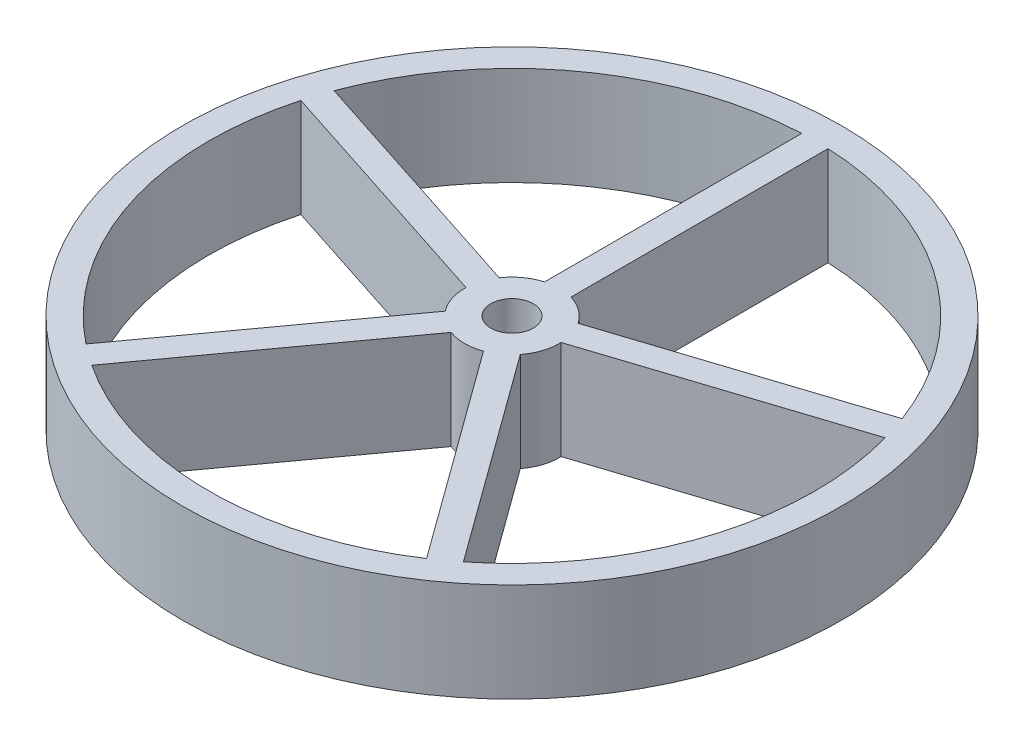
ISO-10303-21;
HEADER;
FILE_DESCRIPTION(('STEP AP214'),'2;1');
FILE_NAME('part.step','',(''),(''),'','','');
FILE_SCHEMA(('AUTOMOTIVE_DESIGN { 1 0 10303 214 1 1 1 1 }'));
ENDSEC;
DATA;
#1=APPLICATION_CONTEXT('core data for automotive mechanical design processes');
#2=APPLICATION_PROTOCOL_DEFINITION('international standard','automotive_design',2000,#1);
#3=PRODUCT_CONTEXT('',#1,'mechanical');
#4=PRODUCT('Part','Part','',(#3));
#5=PRODUCT_RELATED_PRODUCT_CATEGORY('part','',(#4));
#6=PRODUCT_DEFINITION_FORMATION('','',#4);
#7=PRODUCT_DEFINITION_CONTEXT('part definition',#1,'design');
#8=PRODUCT_DEFINITION('design','',#6,#7);
#9=PRODUCT_DEFINITION_SHAPE('','',#8);
#10=(LENGTH_UNIT() NAMED_UNIT(*) SI_UNIT(.MILLI.,.METRE.));
#11=(NAMED_UNIT(*) PLANE_ANGLE_UNIT() SI_UNIT($,.RADIAN.));
#12=(NAMED_UNIT(*) SI_UNIT($,.STERADIAN.) SOLID_ANGLE_UNIT());
#13=UNCERTAINTY_MEASURE_WITH_UNIT(LENGTH_MEASURE(1.E-05),#10,'distance_accuracy_value','');
#14=(GEOMETRIC_REPRESENTATION_CONTEXT(3) GLOBAL_UNCERTAINTY_ASSIGNED_CONTEXT((#13)) GLOBAL_UNIT_ASSIGNED_CONTEXT((#10,
#11,#12)) REPRESENTATION_CONTEXT('',''));
#15=CARTESIAN_POINT('',(0.,0.,0.));
#16=DIRECTION('',(0.,0.,1.));
#17=DIRECTION('',(1.,0.,0.));
#18=AXIS2_PLACEMENT_3D('',#15,#16,#17);
#19=CARTESIAN_POINT('',(0.,7.5,0.));
#20=DIRECTION('',(0.,1.,0.));
#21=DIRECTION('',(0.,0.,1.));
#22=AXIS2_PLACEMENT_3D('',#19,#20,#21);
#23=PLANE('',#22);
#24=DIRECTION('',(0.587785252292706,0.,-0.809016994374778));
#25=VECTOR('',#24,1.);
#26=CARTESIAN_POINT('',(0.809016994375061,7.5,0.587785252292911));
#27=LINE('',#26,#25);
#28=CARTESIAN_POINT('',(-12.6972598236514,7.5,19.1775804774922));
#29=VERTEX_POINT('',#28);
#30=CARTESIAN_POINT('',(-1.22985237637781,7.5,3.39404819239791));
#31=VERTEX_POINT('',#30);
#32=EDGE_CURVE('E294',#29,#31,#27,.T.);
#33=ORIENTED_EDGE('',*,*,#32,.T.);
#34=CARTESIAN_POINT('',(1.60461921527855E-13,7.5,1.00397121172158E-13));
#35=DIRECTION('',(0.,1.,0.));
#36=DIRECTION('',(0.,0.,1.));
#37=AXIS2_PLACEMENT_3D('',#34,#35,#36);
#38=CIRCLE('',#37,3.61000000000019);
#39=CARTESIAN_POINT('',(1.22985237637682,7.5,3.39404819239838));
#40=VERTEX_POINT('',#39);
#41=EDGE_CURVE('E289',#31,#40,#38,.T.);
#42=ORIENTED_EDGE('',*,*,#41,.T.);
#43=DIRECTION('',(-0.587785252292318,0.,-0.80901699437506));
#44=VECTOR('',#43,1.);
#45=CARTESIAN_POINT('',(-0.809016994374873,7.5,0.587785252292182));
#46=LINE('',#45,#44);
#47=CARTESIAN_POINT('',(12.6972598236427,7.5,19.1775804774979));
#48=VERTEX_POINT('',#47);
#49=EDGE_CURVE('E300',#48,#40,#46,.T.);
#50=ORIENTED_EDGE('',*,*,#49,.F.);
#51=CARTESIAN_POINT('',(0.,7.5,0.));
#52=DIRECTION('',(0.,1.,0.));
#53=DIRECTION('',(0.,0.,1.));
#54=AXIS2_PLACEMENT_3D('',#51,#52,#53);
#55=CIRCLE('',#54,23.);
#56=EDGE_CURVE('E297',#29,#48,#55,.T.);
#57=ORIENTED_EDGE('',*,*,#56,.F.);
#58=EDGE_LOOP('',(#33,#42,#50,#57));
#59=FACE_BOUND('',#58,.T.);
#60=DIRECTION('',(-0.951056516295185,0.,0.309016994374852));
#61=VECTOR('',#60,1.);
#62=CARTESIAN_POINT('',(-0.30901699437489,7.5,-0.9510565162953));
#63=LINE('',#62,#61);
#64=CARTESIAN_POINT('',(21.5445979586487,7.5,-8.05172644842021));
#65=VERTEX_POINT('',#64);
#66=CARTESIAN_POINT('',(2.98994294612327,7.5,-2.02295357804612));
#67=VERTEX_POINT('',#66);
#68=EDGE_CURVE('E336',#65,#67,#63,.T.);
#69=ORIENTED_EDGE('',*,*,#68,.T.);
#70=CARTESIAN_POINT('',(1.60461921527855E-13,7.5,1.00397121172158E-13));
#71=DIRECTION('',(0.,1.,0.));
#72=DIRECTION('',(0.,0.,1.));
#73=AXIS2_PLACEMENT_3D('',#70,#71,#72);
#74=CIRCLE('',#73,3.61000000000019);
#75=CARTESIAN_POINT('',(1.,7.5,-3.46873175670893));
#76=VERTEX_POINT('',#75);
#77=EDGE_CURVE('E327',#67,#76,#74,.T.);
#78=ORIENTED_EDGE('',*,*,#77,.T.);
#79=DIRECTION('',(0.,0.,1.));
#80=VECTOR('',#79,1.);
#81=CARTESIAN_POINT('',(1.,7.5,0.));
#82=LINE('',#81,#80);
#83=CARTESIAN_POINT('',(1.,7.5,-22.9782505861521));
#84=VERTEX_POINT('',#83);
#85=EDGE_CURVE('E342',#84,#76,#82,.T.);
#86=ORIENTED_EDGE('',*,*,#85,.F.);
#87=CARTESIAN_POINT('',(0.,7.5,0.));
#88=DIRECTION('',(0.,1.,0.));
#89=DIRECTION('',(0.,0.,1.));
#90=AXIS2_PLACEMENT_3D('',#87,#88,#89);
#91=CIRCLE('',#90,23.);
#92=EDGE_CURVE('E339',#65,#84,#91,.T.);
#93=ORIENTED_EDGE('',*,*,#92,.F.);
#94=EDGE_LOOP('',(#69,#78,#86,#93));
#95=FACE_BOUND('',#94,.T.);
#96=CARTESIAN_POINT('',(0.,7.5,0.));
#97=DIRECTION('',(0.,1.,0.));
#98=DIRECTION('',(0.,0.,1.));
#99=AXIS2_PLACEMENT_3D('',#96,#97,#98);
#100=CIRCLE('',#99,1.61);
#101=CARTESIAN_POINT('',(0.,7.5,1.61));
#102=VERTEX_POINT('',#101);
#103=EDGE_CURVE('E376',#102,#102,#100,.T.);
#104=ORIENTED_EDGE('',*,*,#103,.F.);
#105=EDGE_LOOP('',(#104));
#106=FACE_BOUND('',#105,.T.);
#107=CARTESIAN_POINT('',(0.,7.5,0.));
#108=DIRECTION('',(0.,1.,0.));
#109=DIRECTION('',(0.,0.,1.));
#110=AXIS2_PLACEMENT_3D('',#107,#108,#109);
#111=CIRCLE('',#110,25.);
#112=CARTESIAN_POINT('',(0.,7.5,25.));
#113=VERTEX_POINT('',#112);
#114=EDGE_CURVE('E382',#113,#113,#111,.T.);
#115=ORIENTED_EDGE('',*,*,#114,.T.);
#116=EDGE_LOOP('',(#115));
#117=FACE_BOUND('',#116,.T.);
#118=DIRECTION('',(0.,0.,1.));
#119=VECTOR('',#118,1.);
#120=CARTESIAN_POINT('',(-0.999999999999998,7.5,0.));
#121=LINE('',#120,#119);
#122=CARTESIAN_POINT('',(-1.,7.5,-22.9782505861521));
#123=VERTEX_POINT('',#122);
#124=CARTESIAN_POINT('',(-0.999999999999998,7.5,-3.46873175670883));
#125=VERTEX_POINT('',#124);
#126=EDGE_CURVE('E357',#123,#125,#121,.T.);
#127=ORIENTED_EDGE('',*,*,#126,.T.);
#128=CARTESIAN_POINT('',(1.60461921527855E-13,7.5,1.00397121172158E-13));
#129=DIRECTION('',(0.,1.,0.));
#130=DIRECTION('',(0.,0.,1.));
#131=AXIS2_PLACEMENT_3D('',#128,#129,#130);
#132=CIRCLE('',#131,3.61000000000019);
#133=CARTESIAN_POINT('',(-2.98994294612222,7.5,-2.0229535780472));
#134=VERTEX_POINT('',#133);
#135=EDGE_CURVE('E348',#125,#134,#132,.T.);
#136=ORIENTED_EDGE('',*,*,#135,.T.);
#137=DIRECTION('',(0.951056516295035,0.,0.309016994375312));
#138=VECTOR('',#137,1.);
#139=CARTESIAN_POINT('',(0.309016994375249,7.5,-0.951056516294842));
#140=LINE('',#139,#138);
#141=CARTESIAN_POINT('',(-21.5445979586449,7.5,-8.05172644843032));
#142=VERTEX_POINT('',#141);
#143=EDGE_CURVE('E363',#142,#134,#140,.T.);
#144=ORIENTED_EDGE('',*,*,#143,.F.);
#145=CARTESIAN_POINT('',(0.,7.5,0.));
#146=DIRECTION('',(0.,1.,0.));
#147=DIRECTION('',(0.,0.,1.));
#148=AXIS2_PLACEMENT_3D('',#145,#146,#147);
#149=CIRCLE('',#148,23.);
#150=EDGE_CURVE('E360',#123,#142,#149,.T.);
#151=ORIENTED_EDGE('',*,*,#150,.F.);
#152=EDGE_LOOP('',(#127,#136,#144,#151));
#153=FACE_BOUND('',#152,.T.);
#154=DIRECTION('',(-0.587785252292318,0.,-0.80901699437506));
#155=VECTOR('',#154,1.);
#156=CARTESIAN_POINT('',(0.809016994375245,7.5,-0.587785252292452));
#157=LINE('',#156,#155);
#158=CARTESIAN_POINT('',(14.3152938123928,7.5,18.0020099729133));
#159=VERTEX_POINT('',#158);
#160=CARTESIAN_POINT('',(2.84788636512689,7.5,2.21847768781367));
#161=VERTEX_POINT('',#160);
#162=EDGE_CURVE('E315',#159,#161,#157,.T.);
#163=ORIENTED_EDGE('',*,*,#162,.T.);
#164=CARTESIAN_POINT('',(1.60461921527855E-13,7.5,1.00397121172158E-13));
#165=DIRECTION('',(0.,1.,0.));
#166=DIRECTION('',(0.,0.,1.));
#167=AXIS2_PLACEMENT_3D('',#164,#165,#166);
#168=CIRCLE('',#167,3.61000000000019);
#169=CARTESIAN_POINT('',(3.60797693487312,7.5,-0.1208405454558));
#170=VERTEX_POINT('',#169);
#171=EDGE_CURVE('E306',#161,#170,#168,.T.);
#172=ORIENTED_EDGE('',*,*,#171,.T.);
#173=DIRECTION('',(-0.951056516295185,0.,0.309016994374852));
#174=VECTOR('',#173,1.);
#175=CARTESIAN_POINT('',(0.309016994374816,7.5,0.951056516295071));
#176=LINE('',#175,#174);
#177=CARTESIAN_POINT('',(22.1626319473984,7.5,-6.14961341582985));
#178=VERTEX_POINT('',#177);
#179=EDGE_CURVE('E321',#178,#170,#176,.T.);
#180=ORIENTED_EDGE('',*,*,#179,.F.);
#181=CARTESIAN_POINT('',(0.,7.5,0.));
#182=DIRECTION('',(0.,1.,0.));
#183=DIRECTION('',(0.,0.,1.));
#184=AXIS2_PLACEMENT_3D('',#181,#182,#183);
#185=CIRCLE('',#184,23.);
#186=EDGE_CURVE('E318',#159,#178,#185,.T.);
#187=ORIENTED_EDGE('',*,*,#186,.F.);
#188=EDGE_LOOP('',(#163,#172,#180,#187));
#189=FACE_BOUND('',#188,.T.);
#190=DIRECTION('',(0.951056516295032,0.,0.309016994375323));
#191=VECTOR('',#190,1.);
#192=CARTESIAN_POINT('',(-0.309016994375471,7.5,0.951056516295489));
#193=LINE('',#192,#191);
#194=CARTESIAN_POINT('',(-22.1626319473955,7.5,-6.14961341584022));
#195=VERTEX_POINT('',#194);
#196=CARTESIAN_POINT('',(-3.60797693487277,7.5,-0.120840545456858));
#197=VERTEX_POINT('',#196);
#198=EDGE_CURVE('E277',#195,#197,#193,.T.);
#199=ORIENTED_EDGE('',*,*,#198,.T.);
#200=CARTESIAN_POINT('',(1.60461921527855E-13,7.5,1.00397121172158E-13));
#201=DIRECTION('',(0.,1.,0.));
#202=DIRECTION('',(0.,0.,1.));
#203=AXIS2_PLACEMENT_3D('',#200,#201,#202);
#204=CIRCLE('',#203,3.61000000000019);
#205=CARTESIAN_POINT('',(-2.84788636512742,7.5,2.21847768781257));
#206=VERTEX_POINT('',#205);
#207=EDGE_CURVE('E144',#197,#206,#204,.T.);
#208=ORIENTED_EDGE('',*,*,#207,.T.);
#209=DIRECTION('',(0.587785252292706,0.,-0.809016994374778));
#210=VECTOR('',#209,1.);
#211=CARTESIAN_POINT('',(-0.809016994374497,7.5,-0.587785252292501));
#212=LINE('',#211,#210);
#213=CARTESIAN_POINT('',(-14.3152938124009,7.5,18.0020099729068));
#214=VERTEX_POINT('',#213);
#215=EDGE_CURVE('E282',#214,#206,#212,.T.);
#216=ORIENTED_EDGE('',*,*,#215,.F.);
#217=CARTESIAN_POINT('',(0.,7.5,0.));
#218=DIRECTION('',(0.,1.,0.));
#219=DIRECTION('',(0.,0.,1.));
#220=AXIS2_PLACEMENT_3D('',#217,#218,#219);
#221=CIRCLE('',#220,23.);
#222=EDGE_CURVE('E268',#195,#214,#221,.T.);
#223=ORIENTED_EDGE('',*,*,#222,.F.);
#224=EDGE_LOOP('',(#199,#208,#216,#223));
#225=FACE_BOUND('',#224,.T.);
#226=ADVANCED_FACE('F129',(#59,#95,#106,#117,#153,#189,#225),#23,.T.);
#227=CARTESIAN_POINT('',(0.,0.,0.));
#228=DIRECTION('',(0.,1.,0.));
#229=DIRECTION('',(0.,0.,1.));
#230=AXIS2_PLACEMENT_3D('',#227,#228,#229);
#231=PLANE('',#230);
#232=CARTESIAN_POINT('',(1.60461921527855E-13,0.,1.00397121172158E-13));
#233=DIRECTION('',(0.,1.,0.));
#234=DIRECTION('',(0.,0.,1.));
#235=AXIS2_PLACEMENT_3D('',#232,#233,#234);
#236=CIRCLE('',#235,3.61000000000019);
#237=CARTESIAN_POINT('',(-1.22985237637781,0.,3.39404819239791));
#238=VERTEX_POINT('',#237);
#239=CARTESIAN_POINT('',(1.22985237637682,0.,3.39404819239838));
#240=VERTEX_POINT('',#239);
#241=EDGE_CURVE('E425',#238,#240,#236,.T.);
#242=ORIENTED_EDGE('',*,*,#241,.F.);
#243=DIRECTION('',(0.587785252292706,0.,-0.809016994374778));
#244=VECTOR('',#243,1.);
#245=CARTESIAN_POINT('',(0.809016994375061,0.,0.587785252292911));
#246=LINE('',#245,#244);
#247=CARTESIAN_POINT('',(-12.6972598236514,0.,19.1775804774922));
#248=VERTEX_POINT('',#247);
#249=EDGE_CURVE('E417',#248,#238,#246,.T.);
#250=ORIENTED_EDGE('',*,*,#249,.F.);
#251=CARTESIAN_POINT('',(0.,0.,0.));
#252=DIRECTION('',(0.,1.,0.));
#253=DIRECTION('',(0.,0.,1.));
#254=AXIS2_PLACEMENT_3D('',#251,#252,#253);
#255=CIRCLE('',#254,23.);
#256=CARTESIAN_POINT('',(12.6972598236427,0.,19.1775804774979));
#257=VERTEX_POINT('',#256);
#258=EDGE_CURVE('E419',#248,#257,#255,.T.);
#259=ORIENTED_EDGE('',*,*,#258,.T.);
#260=DIRECTION('',(-0.587785252292318,0.,-0.80901699437506));
#261=VECTOR('',#260,1.);
#262=CARTESIAN_POINT('',(-0.809016994374873,0.,0.587785252292182));
#263=LINE('',#262,#261);
#264=EDGE_CURVE('E422',#257,#240,#263,.T.);
#265=ORIENTED_EDGE('',*,*,#264,.T.);
#266=EDGE_LOOP('',(#242,#250,#259,#265));
#267=FACE_BOUND('',#266,.T.);
#268=CARTESIAN_POINT('',(1.60461921527855E-13,0.,1.00397121172158E-13));
#269=DIRECTION('',(0.,1.,0.));
#270=DIRECTION('',(0.,0.,1.));
#271=AXIS2_PLACEMENT_3D('',#268,#269,#270);
#272=CIRCLE('',#271,3.61000000000019);
#273=CARTESIAN_POINT('',(2.98994294612327,0.,-2.02295357804612));
#274=VERTEX_POINT('',#273);
#275=CARTESIAN_POINT('',(1.,0.,-3.46873175670893));
#276=VERTEX_POINT('',#275);
#277=EDGE_CURVE('E405',#274,#276,#272,.T.);
#278=ORIENTED_EDGE('',*,*,#277,.F.);
#279=DIRECTION('',(-0.951056516295185,0.,0.309016994374852));
#280=VECTOR('',#279,1.);
#281=CARTESIAN_POINT('',(-0.30901699437489,0.,-0.9510565162953));
#282=LINE('',#281,#280);
#283=CARTESIAN_POINT('',(21.5445979586487,0.,-8.05172644842021));
#284=VERTEX_POINT('',#283);
#285=EDGE_CURVE('E397',#284,#274,#282,.T.);
#286=ORIENTED_EDGE('',*,*,#285,.F.);
#287=CARTESIAN_POINT('',(0.,0.,0.));
#288=DIRECTION('',(0.,1.,0.));
#289=DIRECTION('',(0.,0.,1.));
#290=AXIS2_PLACEMENT_3D('',#287,#288,#289);
#291=CIRCLE('',#290,23.);
#292=CARTESIAN_POINT('',(1.,0.,-22.9782505861521));
#293=VERTEX_POINT('',#292);
#294=EDGE_CURVE('E399',#284,#293,#291,.T.);
#295=ORIENTED_EDGE('',*,*,#294,.T.);
#296=DIRECTION('',(0.,0.,1.));
#297=VECTOR('',#296,1.);
#298=CARTESIAN_POINT('',(1.,0.,0.));
#299=LINE('',#298,#297);
#300=EDGE_CURVE('E402',#293,#276,#299,.T.);
#301=ORIENTED_EDGE('',*,*,#300,.T.);
#302=EDGE_LOOP('',(#278,#286,#295,#301));
#303=FACE_BOUND('',#302,.T.);
#304=CARTESIAN_POINT('',(0.,0.,0.));
#305=DIRECTION('',(0.,1.,0.));
#306=DIRECTION('',(0.,0.,1.));
#307=AXIS2_PLACEMENT_3D('',#304,#305,#306);
#308=CIRCLE('',#307,1.61);
#309=CARTESIAN_POINT('',(0.,0.,1.61));
#310=VERTEX_POINT('',#309);
#311=EDGE_CURVE('E369',#310,#310,#308,.T.);
#312=ORIENTED_EDGE('',*,*,#311,.T.);
#313=EDGE_LOOP('',(#312));
#314=FACE_BOUND('',#313,.T.);
#315=CARTESIAN_POINT('',(0.,0.,0.));
#316=DIRECTION('',(0.,1.,0.));
#317=DIRECTION('',(0.,0.,1.));
#318=AXIS2_PLACEMENT_3D('',#315,#316,#317);
#319=CIRCLE('',#318,25.);
#320=CARTESIAN_POINT('',(0.,0.,25.));
#321=VERTEX_POINT('',#320);
#322=EDGE_CURVE('E379',#321,#321,#319,.T.);
#323=ORIENTED_EDGE('',*,*,#322,.F.);
#324=EDGE_LOOP('',(#323));
#325=FACE_BOUND('',#324,.T.);
#326=CARTESIAN_POINT('',(1.60461921527855E-13,0.,1.00397121172158E-13));
#327=DIRECTION('',(0.,1.,0.));
#328=DIRECTION('',(0.,0.,1.));
#329=AXIS2_PLACEMENT_3D('',#326,#327,#328);
#330=CIRCLE('',#329,3.61000000000019);
#331=CARTESIAN_POINT('',(-0.999999999999998,0.,-3.46873175670883));
#332=VERTEX_POINT('',#331);
#333=CARTESIAN_POINT('',(-2.98994294612222,0.,-2.0229535780472));
#334=VERTEX_POINT('',#333);
#335=EDGE_CURVE('E395',#332,#334,#330,.T.);
#336=ORIENTED_EDGE('',*,*,#335,.F.);
#337=DIRECTION('',(0.,0.,1.));
#338=VECTOR('',#337,1.);
#339=CARTESIAN_POINT('',(-0.999999999999998,0.,0.));
#340=LINE('',#339,#338);
#341=CARTESIAN_POINT('',(-1.,0.,-22.9782505861521));
#342=VERTEX_POINT('',#341);
#343=EDGE_CURVE('E385',#342,#332,#340,.T.);
#344=ORIENTED_EDGE('',*,*,#343,.F.);
#345=CARTESIAN_POINT('',(0.,0.,0.));
#346=DIRECTION('',(0.,1.,0.));
#347=DIRECTION('',(0.,0.,1.));
#348=AXIS2_PLACEMENT_3D('',#345,#346,#347);
#349=CIRCLE('',#348,23.);
#350=CARTESIAN_POINT('',(-21.5445979586449,0.,-8.05172644843032));
#351=VERTEX_POINT('',#350);
#352=EDGE_CURVE('E389',#342,#351,#349,.T.);
#353=ORIENTED_EDGE('',*,*,#352,.T.);
#354=DIRECTION('',(0.951056516295035,0.,0.309016994375312));
#355=VECTOR('',#354,1.);
#356=CARTESIAN_POINT('',(0.309016994375249,0.,-0.951056516294842));
#357=LINE('',#356,#355);
#358=EDGE_CURVE('E392',#351,#334,#357,.T.);
#359=ORIENTED_EDGE('',*,*,#358,.T.);
#360=EDGE_LOOP('',(#336,#344,#353,#359));
#361=FACE_BOUND('',#360,.T.);
#362=CARTESIAN_POINT('',(1.60461921527855E-13,0.,1.00397121172158E-13));
#363=DIRECTION('',(0.,1.,0.));
#364=DIRECTION('',(0.,0.,1.));
#365=AXIS2_PLACEMENT_3D('',#362,#363,#364);
#366=CIRCLE('',#365,3.61000000000019);
#367=CARTESIAN_POINT('',(2.84788636512689,0.,2.21847768781367));
#368=VERTEX_POINT('',#367);
#369=CARTESIAN_POINT('',(3.60797693487312,0.,-0.1208405454558));
#370=VERTEX_POINT('',#369);
#371=EDGE_CURVE('E415',#368,#370,#366,.T.);
#372=ORIENTED_EDGE('',*,*,#371,.F.);
#373=DIRECTION('',(-0.587785252292318,0.,-0.80901699437506));
#374=VECTOR('',#373,1.);
#375=CARTESIAN_POINT('',(0.809016994375245,0.,-0.587785252292452));
#376=LINE('',#375,#374);
#377=CARTESIAN_POINT('',(14.3152938123928,0.,18.0020099729133));
#378=VERTEX_POINT('',#377);
#379=EDGE_CURVE('E407',#378,#368,#376,.T.);
#380=ORIENTED_EDGE('',*,*,#379,.F.);
#381=CARTESIAN_POINT('',(0.,0.,0.));
#382=DIRECTION('',(0.,1.,0.));
#383=DIRECTION('',(0.,0.,1.));
#384=AXIS2_PLACEMENT_3D('',#381,#382,#383);
#385=CIRCLE('',#384,23.);
#386=CARTESIAN_POINT('',(22.1626319473984,0.,-6.14961341582985));
#387=VERTEX_POINT('',#386);
#388=EDGE_CURVE('E409',#378,#387,#385,.T.);
#389=ORIENTED_EDGE('',*,*,#388,.T.);
#390=DIRECTION('',(-0.951056516295185,0.,0.309016994374852));
#391=VECTOR('',#390,1.);
#392=CARTESIAN_POINT('',(0.309016994374816,0.,0.951056516295071));
#393=LINE('',#392,#391);
#394=EDGE_CURVE('E412',#387,#370,#393,.T.);
#395=ORIENTED_EDGE('',*,*,#394,.T.);
#396=EDGE_LOOP('',(#372,#380,#389,#395));
#397=FACE_BOUND('',#396,.T.);
#398=CARTESIAN_POINT('',(1.60461921527855E-13,0.,1.00397121172158E-13));
#399=DIRECTION('',(0.,1.,0.));
#400=DIRECTION('',(0.,0.,1.));
#401=AXIS2_PLACEMENT_3D('',#398,#399,#400);
#402=CIRCLE('',#401,3.61000000000019);
#403=CARTESIAN_POINT('',(-3.60797693487277,0.,-0.120840545456858));
#404=VERTEX_POINT('',#403);
#405=CARTESIAN_POINT('',(-2.84788636512742,0.,2.21847768781257));
#406=VERTEX_POINT('',#405);
#407=EDGE_CURVE('E12',#404,#406,#402,.T.);
#408=ORIENTED_EDGE('',*,*,#407,.F.);
#409=DIRECTION('',(0.951056516295032,0.,0.309016994375323));
#410=VECTOR('',#409,1.);
#411=CARTESIAN_POINT('',(-0.309016994375471,0.,0.951056516295488));
#412=LINE('',#411,#410);
#413=CARTESIAN_POINT('',(-22.1626319473955,0.,-6.14961341584022));
#414=VERTEX_POINT('',#413);
#415=EDGE_CURVE('E427',#414,#404,#412,.T.);
#416=ORIENTED_EDGE('',*,*,#415,.F.);
#417=CARTESIAN_POINT('',(0.,0.,0.));
#418=DIRECTION('',(0.,1.,0.));
#419=DIRECTION('',(0.,0.,1.));
#420=AXIS2_PLACEMENT_3D('',#417,#418,#419);
#421=CIRCLE('',#420,23.);
#422=CARTESIAN_POINT('',(-14.3152938124009,0.,18.0020099729068));
#423=VERTEX_POINT('',#422);
#424=EDGE_CURVE('E271',#414,#423,#421,.T.);
#425=ORIENTED_EDGE('',*,*,#424,.T.);
#426=DIRECTION('',(0.587785252292706,0.,-0.809016994374778));
#427=VECTOR('',#426,1.);
#428=CARTESIAN_POINT('',(-0.809016994374497,0.,-0.587785252292501));
#429=LINE('',#428,#427);
#430=EDGE_CURVE('E137',#423,#406,#429,.T.);
#431=ORIENTED_EDGE('',*,*,#430,.T.);
#432=EDGE_LOOP('',(#408,#416,#425,#431));
#433=FACE_BOUND('',#432,.T.);
#434=ADVANCED_FACE('F432',(#267,#303,#314,#325,#361,#397,#433),#231,.F.);
#435=CARTESIAN_POINT('',(0.,7.5,0.));
#436=DIRECTION('',(0.,-1.,0.));
#437=DIRECTION('',(0.,0.,-1.));
#438=AXIS2_PLACEMENT_3D('',#435,#436,#437);
#439=CYLINDRICAL_SURFACE('',#438,25.);
#440=ORIENTED_EDGE('',*,*,#114,.F.);
#441=EDGE_LOOP('',(#440));
#442=FACE_BOUND('',#441,.T.);
#443=ORIENTED_EDGE('',*,*,#322,.T.);
#444=EDGE_LOOP('',(#443));
#445=FACE_BOUND('',#444,.T.);
#446=ADVANCED_FACE('F131',(#442,#445),#439,.T.);
#447=CARTESIAN_POINT('',(0.,7.5,0.));
#448=DIRECTION('',(0.,-1.,0.));
#449=DIRECTION('',(0.,0.,-1.));
#450=AXIS2_PLACEMENT_3D('',#447,#448,#449);
#451=CYLINDRICAL_SURFACE('',#450,1.61);
#452=ORIENTED_EDGE('',*,*,#103,.T.);
#453=EDGE_LOOP('',(#452));
#454=FACE_BOUND('',#453,.T.);
#455=ORIENTED_EDGE('',*,*,#311,.F.);
#456=EDGE_LOOP('',(#455));
#457=FACE_BOUND('',#456,.T.);
#458=ADVANCED_FACE('F459',(#454,#457),#451,.F.);
#459=CARTESIAN_POINT('',(1.60461921527855E-13,-2.5,1.00397121172158E-13));
#460=DIRECTION('',(0.,1.,0.));
#461=DIRECTION('',(0.,0.,1.));
#462=AXIS2_PLACEMENT_3D('',#459,#460,#461);
#463=CYLINDRICAL_SURFACE('',#462,3.61000000000019);
#464=ORIENTED_EDGE('',*,*,#335,.T.);
#465=DIRECTION('',(0.,1.,0.));
#466=VECTOR('',#465,1.);
#467=CARTESIAN_POINT('',(-2.98994294612222,-2.5,-2.0229535780472));
#468=LINE('',#467,#466);
#469=EDGE_CURVE('E367',#334,#134,#468,.T.);
#470=ORIENTED_EDGE('',*,*,#469,.T.);
#471=ORIENTED_EDGE('',*,*,#135,.F.);
#472=DIRECTION('',(0.,1.,0.));
#473=VECTOR('',#472,1.);
#474=CARTESIAN_POINT('',(-0.999999999999998,-2.5,-3.46873175670883));
#475=LINE('',#474,#473);
#476=EDGE_CURVE('E366',#332,#125,#475,.T.);
#477=ORIENTED_EDGE('',*,*,#476,.F.);
#478=EDGE_LOOP('',(#464,#470,#471,#477));
#479=FACE_BOUND('',#478,.T.);
#480=ADVANCED_FACE('F462',(#479),#463,.T.);
#481=CARTESIAN_POINT('',(0.309016994375249,-2.5,-0.951056516294842));
#482=DIRECTION('',(-0.309016994375312,0.,0.951056516295035));
#483=DIRECTION('',(0.951056516295035,0.,0.309016994375312));
#484=AXIS2_PLACEMENT_3D('',#481,#482,#483);
#485=PLANE('',#484);
#486=DIRECTION('',(0.,1.,0.));
#487=VECTOR('',#486,1.);
#488=CARTESIAN_POINT('',(-21.5445979586449,-2.5,-8.05172644843032));
#489=LINE('',#488,#487);
#490=EDGE_CURVE('E370',#351,#142,#489,.T.);
#491=ORIENTED_EDGE('',*,*,#490,.T.);
#492=ORIENTED_EDGE('',*,*,#143,.T.);
#493=ORIENTED_EDGE('',*,*,#469,.F.);
#494=ORIENTED_EDGE('',*,*,#358,.F.);
#495=EDGE_LOOP('',(#491,#492,#493,#494));
#496=FACE_BOUND('',#495,.T.);
#497=ADVANCED_FACE('F466',(#496),#485,.F.);
#498=CARTESIAN_POINT('',(0.,-2.5,0.));
#499=DIRECTION('',(0.,1.,0.));
#500=DIRECTION('',(0.,0.,1.));
#501=AXIS2_PLACEMENT_3D('',#498,#499,#500);
#502=CYLINDRICAL_SURFACE('',#501,23.);
#503=DIRECTION('',(0.,1.,0.));
#504=VECTOR('',#503,1.);
#505=CARTESIAN_POINT('',(-1.,-2.5,-22.9782505861521));
#506=LINE('',#505,#504);
#507=EDGE_CURVE('E372',#342,#123,#506,.T.);
#508=ORIENTED_EDGE('',*,*,#507,.T.);
#509=ORIENTED_EDGE('',*,*,#150,.T.);
#510=ORIENTED_EDGE('',*,*,#490,.F.);
#511=ORIENTED_EDGE('',*,*,#352,.F.);
#512=EDGE_LOOP('',(#508,#509,#510,#511));
#513=FACE_BOUND('',#512,.T.);
#514=ADVANCED_FACE('F472',(#513),#502,.F.);
#515=CARTESIAN_POINT('',(-0.999999999999998,-2.5,0.));
#516=DIRECTION('',(-1.,0.,0.));
#517=DIRECTION('',(0.,0.,1.));
#518=AXIS2_PLACEMENT_3D('',#515,#516,#517);
#519=PLANE('',#518);
#520=ORIENTED_EDGE('',*,*,#343,.T.);
#521=ORIENTED_EDGE('',*,*,#476,.T.);
#522=ORIENTED_EDGE('',*,*,#126,.F.);
#523=ORIENTED_EDGE('',*,*,#507,.F.);
#524=EDGE_LOOP('',(#520,#521,#522,#523));
#525=FACE_BOUND('',#524,.T.);
#526=ADVANCED_FACE('F468',(#525),#519,.T.);
#527=CARTESIAN_POINT('',(1.60461921527855E-13,-2.5,1.00397121172158E-13));
#528=DIRECTION('',(0.,1.,0.));
#529=DIRECTION('',(0.,0.,1.));
#530=AXIS2_PLACEMENT_3D('',#527,#528,#529);
#531=CYLINDRICAL_SURFACE('',#530,3.61000000000019);
#532=ORIENTED_EDGE('',*,*,#277,.T.);
#533=DIRECTION('',(0.,1.,0.));
#534=VECTOR('',#533,1.);
#535=CARTESIAN_POINT('',(1.,-2.5,-3.46873175670893));
#536=LINE('',#535,#534);
#537=EDGE_CURVE('E346',#276,#76,#536,.T.);
#538=ORIENTED_EDGE('',*,*,#537,.T.);
#539=ORIENTED_EDGE('',*,*,#77,.F.);
#540=DIRECTION('',(0.,1.,0.));
#541=VECTOR('',#540,1.);
#542=CARTESIAN_POINT('',(2.98994294612327,-2.5,-2.02295357804612));
#543=LINE('',#542,#541);
#544=EDGE_CURVE('E345',#274,#67,#543,.T.);
#545=ORIENTED_EDGE('',*,*,#544,.F.);
#546=EDGE_LOOP('',(#532,#538,#539,#545));
#547=FACE_BOUND('',#546,.T.);
#548=ADVANCED_FACE('F471',(#547),#531,.T.);
#549=CARTESIAN_POINT('',(1.,-2.5,0.));
#550=DIRECTION('',(-1.,0.,0.));
#551=DIRECTION('',(0.,0.,1.));
#552=AXIS2_PLACEMENT_3D('',#549,#550,#551);
#553=PLANE('',#552);
#554=DIRECTION('',(0.,1.,0.));
#555=VECTOR('',#554,1.);
#556=CARTESIAN_POINT('',(1.,-2.5,-22.9782505861521));
#557=LINE('',#556,#555);
#558=EDGE_CURVE('E349',#293,#84,#557,.T.);
#559=ORIENTED_EDGE('',*,*,#558,.T.);
#560=ORIENTED_EDGE('',*,*,#85,.T.);
#561=ORIENTED_EDGE('',*,*,#537,.F.);
#562=ORIENTED_EDGE('',*,*,#300,.F.);
#563=EDGE_LOOP('',(#559,#560,#561,#562));
#564=FACE_BOUND('',#563,.T.);
#565=ADVANCED_FACE('F482',(#564),#553,.F.);
#566=CARTESIAN_POINT('',(0.,-2.5,0.));
#567=DIRECTION('',(0.,1.,0.));
#568=DIRECTION('',(0.,0.,1.));
#569=AXIS2_PLACEMENT_3D('',#566,#567,#568);
#570=CYLINDRICAL_SURFACE('',#569,23.);
#571=DIRECTION('',(0.,1.,0.));
#572=VECTOR('',#571,1.);
#573=CARTESIAN_POINT('',(21.5445979586487,-2.5,-8.05172644842021));
#574=LINE('',#573,#572);
#575=EDGE_CURVE('E351',#284,#65,#574,.T.);
#576=ORIENTED_EDGE('',*,*,#575,.T.);
#577=ORIENTED_EDGE('',*,*,#92,.T.);
#578=ORIENTED_EDGE('',*,*,#558,.F.);
#579=ORIENTED_EDGE('',*,*,#294,.F.);
#580=EDGE_LOOP('',(#576,#577,#578,#579));
#581=FACE_BOUND('',#580,.T.);
#582=ADVANCED_FACE('F488',(#581),#570,.F.);
#583=CARTESIAN_POINT('',(-0.30901699437489,-2.5,-0.9510565162953));
#584=DIRECTION('',(-0.309016994374852,0.,-0.951056516295185));
#585=DIRECTION('',(-0.951056516295185,0.,0.309016994374852));
#586=AXIS2_PLACEMENT_3D('',#583,#584,#585);
#587=PLANE('',#586);
#588=ORIENTED_EDGE('',*,*,#285,.T.);
#589=ORIENTED_EDGE('',*,*,#544,.T.);
#590=ORIENTED_EDGE('',*,*,#68,.F.);
#591=ORIENTED_EDGE('',*,*,#575,.F.);
#592=EDGE_LOOP('',(#588,#589,#590,#591));
#593=FACE_BOUND('',#592,.T.);
#594=ADVANCED_FACE('F484',(#593),#587,.T.);
#595=CARTESIAN_POINT('',(1.60461921527855E-13,-2.5,1.00397121172158E-13));
#596=DIRECTION('',(0.,1.,0.));
#597=DIRECTION('',(0.,0.,1.));
#598=AXIS2_PLACEMENT_3D('',#595,#596,#597);
#599=CYLINDRICAL_SURFACE('',#598,3.61000000000019);
#600=ORIENTED_EDGE('',*,*,#371,.T.);
#601=DIRECTION('',(0.,1.,0.));
#602=VECTOR('',#601,1.);
#603=CARTESIAN_POINT('',(3.60797693487312,-2.5,-0.1208405454558));
#604=LINE('',#603,#602);
#605=EDGE_CURVE('E325',#370,#170,#604,.T.);
#606=ORIENTED_EDGE('',*,*,#605,.T.);
#607=ORIENTED_EDGE('',*,*,#171,.F.);
#608=DIRECTION('',(0.,1.,0.));
#609=VECTOR('',#608,1.);
#610=CARTESIAN_POINT('',(2.84788636512689,-2.5,2.21847768781367));
#611=LINE('',#610,#609);
#612=EDGE_CURVE('E324',#368,#161,#611,.T.);
#613=ORIENTED_EDGE('',*,*,#612,.F.);
#614=EDGE_LOOP('',(#600,#606,#607,#613));
#615=FACE_BOUND('',#614,.T.);
#616=ADVANCED_FACE('F487',(#615),#599,.T.);
#617=CARTESIAN_POINT('',(0.309016994374816,-2.5,0.951056516295071));
#618=DIRECTION('',(-0.309016994374852,0.,-0.951056516295185));
#619=DIRECTION('',(-0.951056516295185,0.,0.309016994374852));
#620=AXIS2_PLACEMENT_3D('',#617,#618,#619);
#621=PLANE('',#620);
#622=DIRECTION('',(0.,1.,0.));
#623=VECTOR('',#622,1.);
#624=CARTESIAN_POINT('',(22.1626319473984,-2.5,-6.14961341582985));
#625=LINE('',#624,#623);
#626=EDGE_CURVE('E328',#387,#178,#625,.T.);
#627=ORIENTED_EDGE('',*,*,#626,.T.);
#628=ORIENTED_EDGE('',*,*,#179,.T.);
#629=ORIENTED_EDGE('',*,*,#605,.F.);
#630=ORIENTED_EDGE('',*,*,#394,.F.);
#631=EDGE_LOOP('',(#627,#628,#629,#630));
#632=FACE_BOUND('',#631,.T.);
#633=ADVANCED_FACE('F498',(#632),#621,.F.);
#634=CARTESIAN_POINT('',(0.,-2.5,0.));
#635=DIRECTION('',(0.,1.,0.));
#636=DIRECTION('',(0.,0.,1.));
#637=AXIS2_PLACEMENT_3D('',#634,#635,#636);
#638=CYLINDRICAL_SURFACE('',#637,23.);
#639=DIRECTION('',(0.,1.,0.));
#640=VECTOR('',#639,1.);
#641=CARTESIAN_POINT('',(14.3152938123928,-2.5,18.0020099729133));
#642=LINE('',#641,#640);
#643=EDGE_CURVE('E330',#378,#159,#642,.T.);
#644=ORIENTED_EDGE('',*,*,#643,.T.);
#645=ORIENTED_EDGE('',*,*,#186,.T.);
#646=ORIENTED_EDGE('',*,*,#626,.F.);
#647=ORIENTED_EDGE('',*,*,#388,.F.);
#648=EDGE_LOOP('',(#644,#645,#646,#647));
#649=FACE_BOUND('',#648,.T.);
#650=ADVANCED_FACE('F504',(#649),#638,.F.);
#651=CARTESIAN_POINT('',(0.809016994375245,-2.5,-0.587785252292452));
#652=DIRECTION('',(0.80901699437506,0.,-0.587785252292318));
#653=DIRECTION('',(-0.587785252292318,0.,-0.80901699437506));
#654=AXIS2_PLACEMENT_3D('',#651,#652,#653);
#655=PLANE('',#654);
#656=ORIENTED_EDGE('',*,*,#379,.T.);
#657=ORIENTED_EDGE('',*,*,#612,.T.);
#658=ORIENTED_EDGE('',*,*,#162,.F.);
#659=ORIENTED_EDGE('',*,*,#643,.F.);
#660=EDGE_LOOP('',(#656,#657,#658,#659));
#661=FACE_BOUND('',#660,.T.);
#662=ADVANCED_FACE('F500',(#661),#655,.T.);
#663=CARTESIAN_POINT('',(1.60461921527855E-13,-2.5,1.00397121172158E-13));
#664=DIRECTION('',(0.,1.,0.));
#665=DIRECTION('',(0.,0.,1.));
#666=AXIS2_PLACEMENT_3D('',#663,#664,#665);
#667=CYLINDRICAL_SURFACE('',#666,3.61000000000019);
#668=ORIENTED_EDGE('',*,*,#241,.T.);
#669=DIRECTION('',(0.,1.,0.));
#670=VECTOR('',#669,1.);
#671=CARTESIAN_POINT('',(1.22985237637682,-2.5,3.39404819239838));
#672=LINE('',#671,#670);
#673=EDGE_CURVE('E304',#240,#40,#672,.T.);
#674=ORIENTED_EDGE('',*,*,#673,.T.);
#675=ORIENTED_EDGE('',*,*,#41,.F.);
#676=DIRECTION('',(0.,1.,0.));
#677=VECTOR('',#676,1.);
#678=CARTESIAN_POINT('',(-1.22985237637781,-2.5,3.39404819239791));
#679=LINE('',#678,#677);
#680=EDGE_CURVE('E303',#238,#31,#679,.T.);
#681=ORIENTED_EDGE('',*,*,#680,.F.);
#682=EDGE_LOOP('',(#668,#674,#675,#681));
#683=FACE_BOUND('',#682,.T.);
#684=ADVANCED_FACE('F503',(#683),#667,.T.);
#685=CARTESIAN_POINT('',(-0.809016994374873,-2.5,0.587785252292182));
#686=DIRECTION('',(0.80901699437506,0.,-0.587785252292318));
#687=DIRECTION('',(-0.587785252292318,0.,-0.80901699437506));
#688=AXIS2_PLACEMENT_3D('',#685,#686,#687);
#689=PLANE('',#688);
#690=DIRECTION('',(0.,1.,0.));
#691=VECTOR('',#690,1.);
#692=CARTESIAN_POINT('',(12.6972598236427,-2.5,19.1775804774979));
#693=LINE('',#692,#691);
#694=EDGE_CURVE('E307',#257,#48,#693,.T.);
#695=ORIENTED_EDGE('',*,*,#694,.T.);
#696=ORIENTED_EDGE('',*,*,#49,.T.);
#697=ORIENTED_EDGE('',*,*,#673,.F.);
#698=ORIENTED_EDGE('',*,*,#264,.F.);
#699=EDGE_LOOP('',(#695,#696,#697,#698));
#700=FACE_BOUND('',#699,.T.);
#701=ADVANCED_FACE('F513',(#700),#689,.F.);
#702=CARTESIAN_POINT('',(0.,-2.5,0.));
#703=DIRECTION('',(0.,1.,0.));
#704=DIRECTION('',(0.,0.,1.));
#705=AXIS2_PLACEMENT_3D('',#702,#703,#704);
#706=CYLINDRICAL_SURFACE('',#705,23.);
#707=DIRECTION('',(0.,1.,0.));
#708=VECTOR('',#707,1.);
#709=CARTESIAN_POINT('',(-12.6972598236514,-2.5,19.1775804774922));
#710=LINE('',#709,#708);
#711=EDGE_CURVE('E309',#248,#29,#710,.T.);
#712=ORIENTED_EDGE('',*,*,#711,.T.);
#713=ORIENTED_EDGE('',*,*,#56,.T.);
#714=ORIENTED_EDGE('',*,*,#694,.F.);
#715=ORIENTED_EDGE('',*,*,#258,.F.);
#716=EDGE_LOOP('',(#712,#713,#714,#715));
#717=FACE_BOUND('',#716,.T.);
#718=ADVANCED_FACE('F445',(#717),#706,.F.);
#719=CARTESIAN_POINT('',(0.809016994375061,-2.5,0.587785252292911));
#720=DIRECTION('',(0.809016994374778,0.,0.587785252292706));
#721=DIRECTION('',(0.587785252292706,0.,-0.809016994374778));
#722=AXIS2_PLACEMENT_3D('',#719,#720,#721);
#723=PLANE('',#722);
#724=ORIENTED_EDGE('',*,*,#249,.T.);
#725=ORIENTED_EDGE('',*,*,#680,.T.);
#726=ORIENTED_EDGE('',*,*,#32,.F.);
#727=ORIENTED_EDGE('',*,*,#711,.F.);
#728=EDGE_LOOP('',(#724,#725,#726,#727));
#729=FACE_BOUND('',#728,.T.);
#730=ADVANCED_FACE('F438',(#729),#723,.T.);
#731=CARTESIAN_POINT('',(1.60461921527855E-13,-2.5,1.00397121172158E-13));
#732=DIRECTION('',(0.,1.,0.));
#733=DIRECTION('',(0.,0.,1.));
#734=AXIS2_PLACEMENT_3D('',#731,#732,#733);
#735=CYLINDRICAL_SURFACE('',#734,3.61000000000019);
#736=ORIENTED_EDGE('',*,*,#407,.T.);
#737=DIRECTION('',(0.,1.,0.));
#738=VECTOR('',#737,1.);
#739=CARTESIAN_POINT('',(-2.84788636512742,-2.5,2.21847768781257));
#740=LINE('',#739,#738);
#741=EDGE_CURVE('E287',#406,#206,#740,.T.);
#742=ORIENTED_EDGE('',*,*,#741,.T.);
#743=ORIENTED_EDGE('',*,*,#207,.F.);
#744=DIRECTION('',(0.,1.,0.));
#745=VECTOR('',#744,1.);
#746=CARTESIAN_POINT('',(-3.60797693487277,-2.5,-0.120840545456858));
#747=LINE('',#746,#745);
#748=EDGE_CURVE('E274',#404,#197,#747,.T.);
#749=ORIENTED_EDGE('',*,*,#748,.F.);
#750=EDGE_LOOP('',(#736,#742,#743,#749));
#751=FACE_BOUND('',#750,.T.);
#752=ADVANCED_FACE('F436',(#751),#735,.T.);
#753=CARTESIAN_POINT('',(-0.809016994374497,-2.5,-0.587785252292501));
#754=DIRECTION('',(0.809016994374778,0.,0.587785252292706));
#755=DIRECTION('',(0.587785252292706,0.,-0.809016994374778));
#756=AXIS2_PLACEMENT_3D('',#753,#754,#755);
#757=PLANE('',#756);
#758=DIRECTION('',(0.,1.,0.));
#759=VECTOR('',#758,1.);
#760=CARTESIAN_POINT('',(-14.3152938124009,-2.5,18.0020099729068));
#761=LINE('',#760,#759);
#762=EDGE_CURVE('E273',#423,#214,#761,.T.);
#763=ORIENTED_EDGE('',*,*,#762,.T.);
#764=ORIENTED_EDGE('',*,*,#215,.T.);
#765=ORIENTED_EDGE('',*,*,#741,.F.);
#766=ORIENTED_EDGE('',*,*,#430,.F.);
#767=EDGE_LOOP('',(#763,#764,#765,#766));
#768=FACE_BOUND('',#767,.T.);
#769=ADVANCED_FACE('F435',(#768),#757,.F.);
#770=CARTESIAN_POINT('',(0.,-2.5,0.));
#771=DIRECTION('',(0.,1.,0.));
#772=DIRECTION('',(0.,0.,1.));
#773=AXIS2_PLACEMENT_3D('',#770,#771,#772);
#774=CYLINDRICAL_SURFACE('',#773,23.);
#775=DIRECTION('',(0.,1.,0.));
#776=VECTOR('',#775,1.);
#777=CARTESIAN_POINT('',(-22.1626319473955,-2.5,-6.14961341584022));
#778=LINE('',#777,#776);
#779=EDGE_CURVE('E152',#414,#195,#778,.T.);
#780=ORIENTED_EDGE('',*,*,#779,.T.);
#781=ORIENTED_EDGE('',*,*,#222,.T.);
#782=ORIENTED_EDGE('',*,*,#762,.F.);
#783=ORIENTED_EDGE('',*,*,#424,.F.);
#784=EDGE_LOOP('',(#780,#781,#782,#783));
#785=FACE_BOUND('',#784,.T.);
#786=ADVANCED_FACE('F265',(#785),#774,.F.);
#787=CARTESIAN_POINT('',(-0.309016994375471,-2.5,0.951056516295489));
#788=DIRECTION('',(-0.309016994375323,0.,0.951056516295032));
#789=DIRECTION('',(0.951056516295032,0.,0.309016994375323));
#790=AXIS2_PLACEMENT_3D('',#787,#788,#789);
#791=PLANE('',#790);
#792=ORIENTED_EDGE('',*,*,#415,.T.);
#793=ORIENTED_EDGE('',*,*,#748,.T.);
#794=ORIENTED_EDGE('',*,*,#198,.F.);
#795=ORIENTED_EDGE('',*,*,#779,.F.);
#796=EDGE_LOOP('',(#792,#793,#794,#795));
#797=FACE_BOUND('',#796,.T.);
#798=ADVANCED_FACE('F278',(#797),#791,.T.);
#799=CLOSED_SHELL('',(#226,#434,#446,#458,#480,#497,#514,#526,#548,#565,#582,#594,#616,#633,
#650,#662,#684,#701,#718,#730,#752,#769,#786,#798));
#800=MANIFOLD_SOLID_BREP('B2',#799);
#801=ADVANCED_BREP_SHAPE_REPRESENTATION('',(#18,#800),#14);
#802=SHAPE_DEFINITION_REPRESENTATION(#9,#801);
ENDSEC;
END-ISO-10303-21;
